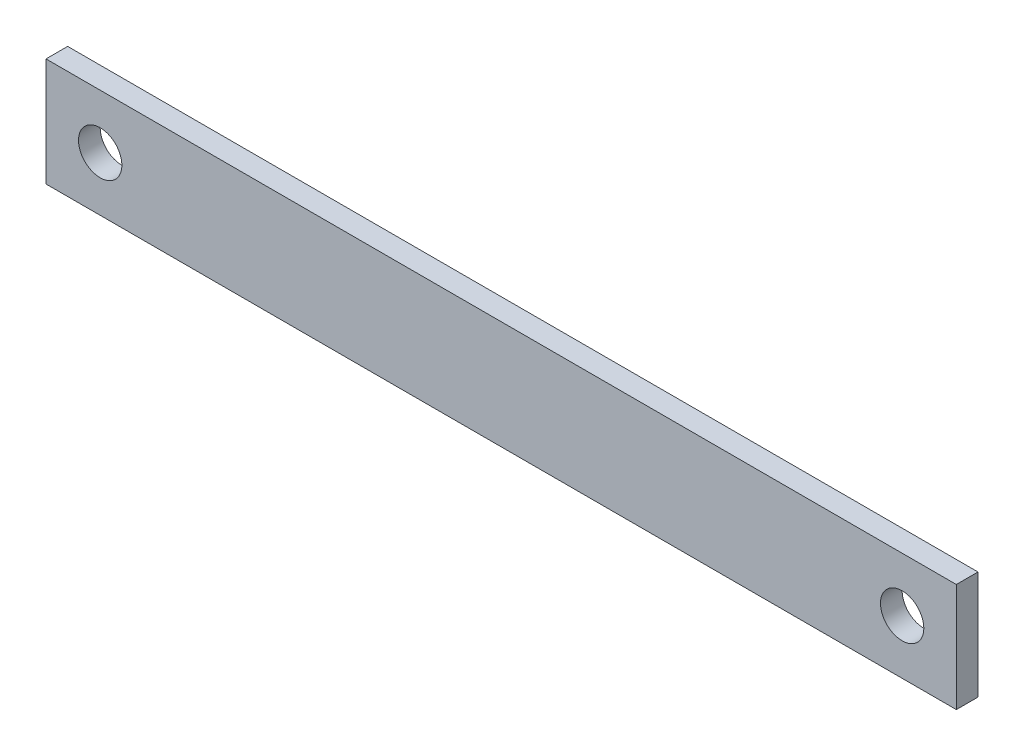
ISO-10303-21;
HEADER;
FILE_DESCRIPTION(('STEP AP214'),'2;1');
FILE_NAME('part.step','',(''),(''),'','','');
FILE_SCHEMA(('AUTOMOTIVE_DESIGN { 1 0 10303 214 1 1 1 1 }'));
ENDSEC;
DATA;
#1=APPLICATION_CONTEXT('core data for automotive mechanical design processes');
#2=APPLICATION_PROTOCOL_DEFINITION('international standard','automotive_design',2000,#1);
#3=PRODUCT_CONTEXT('',#1,'mechanical');
#4=PRODUCT('Part','Part','',(#3));
#5=PRODUCT_RELATED_PRODUCT_CATEGORY('part','',(#4));
#6=PRODUCT_DEFINITION_FORMATION('','',#4);
#7=PRODUCT_DEFINITION_CONTEXT('part definition',#1,'design');
#8=PRODUCT_DEFINITION('design','',#6,#7);
#9=PRODUCT_DEFINITION_SHAPE('','',#8);
#10=(LENGTH_UNIT() NAMED_UNIT(*) SI_UNIT(.MILLI.,.METRE.));
#11=(NAMED_UNIT(*) PLANE_ANGLE_UNIT() SI_UNIT($,.RADIAN.));
#12=(NAMED_UNIT(*) SI_UNIT($,.STERADIAN.) SOLID_ANGLE_UNIT());
#13=UNCERTAINTY_MEASURE_WITH_UNIT(LENGTH_MEASURE(1.E-05),#10,'distance_accuracy_value','');
#14=(GEOMETRIC_REPRESENTATION_CONTEXT(3) GLOBAL_UNCERTAINTY_ASSIGNED_CONTEXT((#13)) GLOBAL_UNIT_ASSIGNED_CONTEXT((#10,
#11,#12)) REPRESENTATION_CONTEXT('',''));
#15=CARTESIAN_POINT('',(0.,0.,0.));
#16=DIRECTION('',(0.,0.,1.));
#17=DIRECTION('',(1.,0.,0.));
#18=AXIS2_PLACEMENT_3D('',#15,#16,#17);
#19=CARTESIAN_POINT('',(-63.8590727772873,-4.16857836185069,2.));
#20=DIRECTION('',(-1.,0.,0.));
#21=DIRECTION('',(0.,0.,1.));
#22=AXIS2_PLACEMENT_3D('',#19,#20,#21);
#23=PLANE('',#22);
#24=DIRECTION('',(0.,1.,0.));
#25=VECTOR('',#24,1.);
#26=CARTESIAN_POINT('',(-63.8590727772873,-4.16857836185069,0.));
#27=LINE('',#26,#25);
#28=CARTESIAN_POINT('',(-63.8590727772873,-4.16857836185069,0.));
#29=VERTEX_POINT('',#28);
#30=CARTESIAN_POINT('',(-63.8590727772873,5.83142163814931,0.));
#31=VERTEX_POINT('',#30);
#32=EDGE_CURVE('E101',#29,#31,#27,.T.);
#33=ORIENTED_EDGE('',*,*,#32,.F.);
#34=DIRECTION('',(0.,0.,-1.));
#35=VECTOR('',#34,1.);
#36=CARTESIAN_POINT('',(-63.8590727772873,-4.16857836185069,2.));
#37=LINE('',#36,#35);
#38=CARTESIAN_POINT('',(-63.8590727772873,-4.16857836185069,2.));
#39=VERTEX_POINT('',#38);
#40=EDGE_CURVE('E11',#39,#29,#37,.T.);
#41=ORIENTED_EDGE('',*,*,#40,.F.);
#42=DIRECTION('',(0.,1.,0.));
#43=VECTOR('',#42,1.);
#44=CARTESIAN_POINT('',(-63.8590727772873,-4.16857836185069,2.));
#45=LINE('',#44,#43);
#46=CARTESIAN_POINT('',(-63.8590727772873,5.83142163814931,2.));
#47=VERTEX_POINT('',#46);
#48=EDGE_CURVE('E95',#39,#47,#45,.T.);
#49=ORIENTED_EDGE('',*,*,#48,.T.);
#50=DIRECTION('',(0.,0.,-1.));
#51=VECTOR('',#50,1.);
#52=CARTESIAN_POINT('',(-63.8590727772873,5.83142163814931,2.));
#53=LINE('',#52,#51);
#54=EDGE_CURVE('E74',#47,#31,#53,.T.);
#55=ORIENTED_EDGE('',*,*,#54,.T.);
#56=EDGE_LOOP('',(#33,#41,#49,#55));
#57=FACE_BOUND('',#56,.T.);
#58=ADVANCED_FACE('F33',(#57),#23,.T.);
#59=CARTESIAN_POINT('',(-63.8590727772873,-4.16857836185069,2.));
#60=DIRECTION('',(0.,1.,0.));
#61=DIRECTION('',(0.,0.,1.));
#62=AXIS2_PLACEMENT_3D('',#59,#60,#61);
#63=PLANE('',#62);
#64=DIRECTION('',(1.,0.,0.));
#65=VECTOR('',#64,1.);
#66=CARTESIAN_POINT('',(-63.8590727772873,-4.16857836185069,0.));
#67=LINE('',#66,#65);
#68=CARTESIAN_POINT('',(20.1409272227127,-4.16857836185069,0.));
#69=VERTEX_POINT('',#68);
#70=EDGE_CURVE('E66',#29,#69,#67,.T.);
#71=ORIENTED_EDGE('',*,*,#70,.T.);
#72=DIRECTION('',(0.,0.,-1.));
#73=VECTOR('',#72,1.);
#74=CARTESIAN_POINT('',(20.1409272227127,-4.16857836185069,2.));
#75=LINE('',#74,#73);
#76=CARTESIAN_POINT('',(20.1409272227127,-4.16857836185069,2.));
#77=VERTEX_POINT('',#76);
#78=EDGE_CURVE('E42',#77,#69,#75,.T.);
#79=ORIENTED_EDGE('',*,*,#78,.F.);
#80=DIRECTION('',(1.,0.,0.));
#81=VECTOR('',#80,1.);
#82=CARTESIAN_POINT('',(-63.8590727772873,-4.16857836185069,2.));
#83=LINE('',#82,#81);
#84=EDGE_CURVE('E84',#39,#77,#83,.T.);
#85=ORIENTED_EDGE('',*,*,#84,.F.);
#86=ORIENTED_EDGE('',*,*,#40,.T.);
#87=EDGE_LOOP('',(#71,#79,#85,#86));
#88=FACE_BOUND('',#87,.T.);
#89=ADVANCED_FACE('F138',(#88),#63,.F.);
#90=CARTESIAN_POINT('',(20.1409272227127,-4.16857836185069,2.));
#91=DIRECTION('',(-1.,0.,0.));
#92=DIRECTION('',(0.,0.,1.));
#93=AXIS2_PLACEMENT_3D('',#90,#91,#92);
#94=PLANE('',#93);
#95=DIRECTION('',(0.,1.,0.));
#96=VECTOR('',#95,1.);
#97=CARTESIAN_POINT('',(20.1409272227127,-4.16857836185069,0.));
#98=LINE('',#97,#96);
#99=CARTESIAN_POINT('',(20.1409272227127,5.83142163814931,0.));
#100=VERTEX_POINT('',#99);
#101=EDGE_CURVE('E91',#69,#100,#98,.T.);
#102=ORIENTED_EDGE('',*,*,#101,.T.);
#103=DIRECTION('',(0.,0.,-1.));
#104=VECTOR('',#103,1.);
#105=CARTESIAN_POINT('',(20.1409272227127,5.83142163814931,2.));
#106=LINE('',#105,#104);
#107=CARTESIAN_POINT('',(20.1409272227127,5.83142163814931,2.));
#108=VERTEX_POINT('',#107);
#109=EDGE_CURVE('E88',#108,#100,#106,.T.);
#110=ORIENTED_EDGE('',*,*,#109,.F.);
#111=DIRECTION('',(0.,1.,0.));
#112=VECTOR('',#111,1.);
#113=CARTESIAN_POINT('',(20.1409272227127,-4.16857836185069,2.));
#114=LINE('',#113,#112);
#115=EDGE_CURVE('E79',#77,#108,#114,.T.);
#116=ORIENTED_EDGE('',*,*,#115,.F.);
#117=ORIENTED_EDGE('',*,*,#78,.T.);
#118=EDGE_LOOP('',(#102,#110,#116,#117));
#119=FACE_BOUND('',#118,.T.);
#120=ADVANCED_FACE('F89',(#119),#94,.F.);
#121=CARTESIAN_POINT('',(-63.8590727772873,5.83142163814931,2.));
#122=DIRECTION('',(0.,1.,0.));
#123=DIRECTION('',(0.,0.,1.));
#124=AXIS2_PLACEMENT_3D('',#121,#122,#123);
#125=PLANE('',#124);
#126=DIRECTION('',(1.,0.,0.));
#127=VECTOR('',#126,1.);
#128=CARTESIAN_POINT('',(-63.8590727772873,5.83142163814931,0.));
#129=LINE('',#128,#127);
#130=EDGE_CURVE('E104',#31,#100,#129,.T.);
#131=ORIENTED_EDGE('',*,*,#130,.F.);
#132=ORIENTED_EDGE('',*,*,#54,.F.);
#133=DIRECTION('',(1.,0.,0.));
#134=VECTOR('',#133,1.);
#135=CARTESIAN_POINT('',(-63.8590727772873,5.83142163814931,2.));
#136=LINE('',#135,#134);
#137=EDGE_CURVE('E83',#47,#108,#136,.T.);
#138=ORIENTED_EDGE('',*,*,#137,.T.);
#139=ORIENTED_EDGE('',*,*,#109,.T.);
#140=EDGE_LOOP('',(#131,#132,#138,#139));
#141=FACE_BOUND('',#140,.T.);
#142=ADVANCED_FACE('F94',(#141),#125,.T.);
#143=CARTESIAN_POINT('',(0.,0.,2.));
#144=DIRECTION('',(0.,0.,-1.));
#145=DIRECTION('',(-1.,0.,0.));
#146=AXIS2_PLACEMENT_3D('',#143,#144,#145);
#147=PLANE('',#146);
#148=CARTESIAN_POINT('',(15.1409272227127,0.831421638149306,2.));
#149=DIRECTION('',(0.,0.,1.));
#150=DIRECTION('',(1.,0.,0.));
#151=AXIS2_PLACEMENT_3D('',#148,#149,#150);
#152=CIRCLE('',#151,2.);
#153=CARTESIAN_POINT('',(17.1409272227127,0.831421638149306,2.));
#154=VERTEX_POINT('',#153);
#155=EDGE_CURVE('E118',#154,#154,#152,.T.);
#156=ORIENTED_EDGE('',*,*,#155,.F.);
#157=EDGE_LOOP('',(#156));
#158=FACE_BOUND('',#157,.T.);
#159=CARTESIAN_POINT('',(-58.8590727772873,0.831421638149306,2.));
#160=DIRECTION('',(0.,0.,1.));
#161=DIRECTION('',(1.,0.,0.));
#162=AXIS2_PLACEMENT_3D('',#159,#160,#161);
#163=CIRCLE('',#162,2.);
#164=CARTESIAN_POINT('',(-56.8590727772873,0.831421638149306,2.));
#165=VERTEX_POINT('',#164);
#166=EDGE_CURVE('E111',#165,#165,#163,.T.);
#167=ORIENTED_EDGE('',*,*,#166,.F.);
#168=EDGE_LOOP('',(#167));
#169=FACE_BOUND('',#168,.T.);
#170=ORIENTED_EDGE('',*,*,#48,.F.);
#171=ORIENTED_EDGE('',*,*,#84,.T.);
#172=ORIENTED_EDGE('',*,*,#115,.T.);
#173=ORIENTED_EDGE('',*,*,#137,.F.);
#174=EDGE_LOOP('',(#170,#171,#172,#173));
#175=FACE_BOUND('',#174,.T.);
#176=ADVANCED_FACE('F82',(#158,#169,#175),#147,.F.);
#177=CARTESIAN_POINT('',(0.,0.,0.));
#178=DIRECTION('',(0.,0.,-1.));
#179=DIRECTION('',(-1.,0.,0.));
#180=AXIS2_PLACEMENT_3D('',#177,#178,#179);
#181=PLANE('',#180);
#182=CARTESIAN_POINT('',(15.1409272227127,0.831421638149306,0.));
#183=DIRECTION('',(0.,0.,-1.));
#184=DIRECTION('',(-1.,0.,0.));
#185=AXIS2_PLACEMENT_3D('',#182,#183,#184);
#186=CIRCLE('',#185,2.);
#187=CARTESIAN_POINT('',(13.1409272227127,0.831421638149306,0.));
#188=VERTEX_POINT('',#187);
#189=EDGE_CURVE('E36',#188,#188,#186,.T.);
#190=ORIENTED_EDGE('',*,*,#189,.F.);
#191=EDGE_LOOP('',(#190));
#192=FACE_BOUND('',#191,.T.);
#193=CARTESIAN_POINT('',(-58.8590727772873,0.831421638149306,0.));
#194=DIRECTION('',(0.,0.,-1.));
#195=DIRECTION('',(-1.,0.,0.));
#196=AXIS2_PLACEMENT_3D('',#193,#194,#195);
#197=CIRCLE('',#196,2.);
#198=CARTESIAN_POINT('',(-60.8590727772873,0.831421638149306,0.));
#199=VERTEX_POINT('',#198);
#200=EDGE_CURVE('E105',#199,#199,#197,.T.);
#201=ORIENTED_EDGE('',*,*,#200,.F.);
#202=EDGE_LOOP('',(#201));
#203=FACE_BOUND('',#202,.T.);
#204=ORIENTED_EDGE('',*,*,#32,.T.);
#205=ORIENTED_EDGE('',*,*,#130,.T.);
#206=ORIENTED_EDGE('',*,*,#101,.F.);
#207=ORIENTED_EDGE('',*,*,#70,.F.);
#208=EDGE_LOOP('',(#204,#205,#206,#207));
#209=FACE_BOUND('',#208,.T.);
#210=ADVANCED_FACE('F127',(#192,#203,#209),#181,.T.);
#211=CARTESIAN_POINT('',(-58.8590727772873,0.831421638149306,-8.));
#212=DIRECTION('',(0.,0.,1.));
#213=DIRECTION('',(1.,0.,0.));
#214=AXIS2_PLACEMENT_3D('',#211,#212,#213);
#215=CYLINDRICAL_SURFACE('',#214,2.);
#216=ORIENTED_EDGE('',*,*,#200,.T.);
#217=EDGE_LOOP('',(#216));
#218=FACE_BOUND('',#217,.T.);
#219=ORIENTED_EDGE('',*,*,#166,.T.);
#220=EDGE_LOOP('',(#219));
#221=FACE_BOUND('',#220,.T.);
#222=ADVANCED_FACE('F133',(#218,#221),#215,.F.);
#223=CARTESIAN_POINT('',(15.1409272227127,0.831421638149306,-8.));
#224=DIRECTION('',(0.,0.,1.));
#225=DIRECTION('',(1.,0.,0.));
#226=AXIS2_PLACEMENT_3D('',#223,#224,#225);
#227=CYLINDRICAL_SURFACE('',#226,2.);
#228=ORIENTED_EDGE('',*,*,#189,.T.);
#229=EDGE_LOOP('',(#228));
#230=FACE_BOUND('',#229,.T.);
#231=ORIENTED_EDGE('',*,*,#155,.T.);
#232=EDGE_LOOP('',(#231));
#233=FACE_BOUND('',#232,.T.);
#234=ADVANCED_FACE('F123',(#230,#233),#227,.F.);
#235=CLOSED_SHELL('',(#58,#89,#120,#142,#176,#210,#222,#234));
#236=MANIFOLD_SOLID_BREP('B2',#235);
#237=ADVANCED_BREP_SHAPE_REPRESENTATION('',(#18,#236),#14);
#238=SHAPE_DEFINITION_REPRESENTATION(#9,#237);
ENDSEC;
END-ISO-10303-21;
